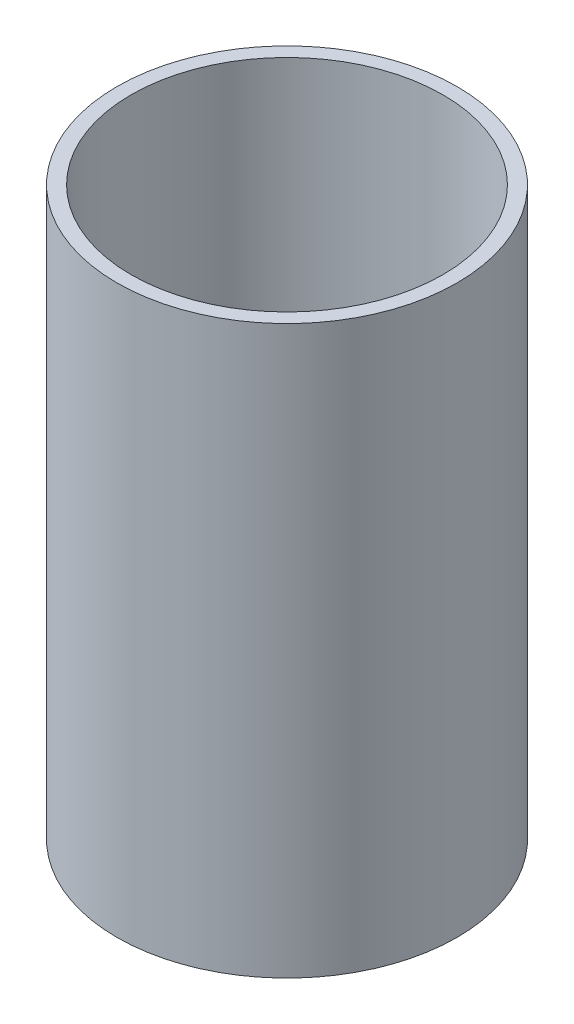
ISO-10303-21;
HEADER;
FILE_DESCRIPTION(('STEP AP214'),'2;1');
FILE_NAME('part.step','',(''),(''),'','','');
FILE_SCHEMA(('AUTOMOTIVE_DESIGN { 1 0 10303 214 1 1 1 1 }'));
ENDSEC;
DATA;
#1=APPLICATION_CONTEXT('core data for automotive mechanical design processes');
#2=APPLICATION_PROTOCOL_DEFINITION('international standard','automotive_design',2000,#1);
#3=PRODUCT_CONTEXT('',#1,'mechanical');
#4=PRODUCT('Part','Part','',(#3));
#5=PRODUCT_RELATED_PRODUCT_CATEGORY('part','',(#4));
#6=PRODUCT_DEFINITION_FORMATION('','',#4);
#7=PRODUCT_DEFINITION_CONTEXT('part definition',#1,'design');
#8=PRODUCT_DEFINITION('design','',#6,#7);
#9=PRODUCT_DEFINITION_SHAPE('','',#8);
#10=(LENGTH_UNIT() NAMED_UNIT(*) SI_UNIT(.MILLI.,.METRE.));
#11=(NAMED_UNIT(*) PLANE_ANGLE_UNIT() SI_UNIT($,.RADIAN.));
#12=(NAMED_UNIT(*) SI_UNIT($,.STERADIAN.) SOLID_ANGLE_UNIT());
#13=UNCERTAINTY_MEASURE_WITH_UNIT(LENGTH_MEASURE(1.E-05),#10,'distance_accuracy_value','');
#14=(GEOMETRIC_REPRESENTATION_CONTEXT(3) GLOBAL_UNCERTAINTY_ASSIGNED_CONTEXT((#13)) GLOBAL_UNIT_ASSIGNED_CONTEXT((#10,
#11,#12)) REPRESENTATION_CONTEXT('',''));
#15=CARTESIAN_POINT('',(0.,0.,0.));
#16=DIRECTION('',(0.,0.,1.));
#17=DIRECTION('',(1.,0.,0.));
#18=AXIS2_PLACEMENT_3D('',#15,#16,#17);
#19=CARTESIAN_POINT('',(0.,20.,0.));
#20=DIRECTION('',(0.,1.,0.));
#21=DIRECTION('',(0.,0.,1.));
#22=AXIS2_PLACEMENT_3D('',#19,#20,#21);
#23=PLANE('',#22);
#24=CARTESIAN_POINT('',(0.,20.,0.));
#25=DIRECTION('',(0.,1.,0.));
#26=DIRECTION('',(0.,0.,1.));
#27=AXIS2_PLACEMENT_3D('',#24,#25,#26);
#28=CIRCLE('',#27,6.);
#29=CARTESIAN_POINT('',(0.,20.,6.));
#30=VERTEX_POINT('',#29);
#31=EDGE_CURVE('E10',#30,#30,#28,.T.);
#32=ORIENTED_EDGE('',*,*,#31,.T.);
#33=EDGE_LOOP('',(#32));
#34=FACE_BOUND('',#33,.T.);
#35=CARTESIAN_POINT('',(0.,20.,0.));
#36=DIRECTION('',(0.,1.,0.));
#37=DIRECTION('',(0.,0.,1.));
#38=AXIS2_PLACEMENT_3D('',#35,#36,#37);
#39=CIRCLE('',#38,5.5);
#40=CARTESIAN_POINT('',(0.,20.,5.5));
#41=VERTEX_POINT('',#40);
#42=EDGE_CURVE('E46',#41,#41,#39,.T.);
#43=ORIENTED_EDGE('',*,*,#42,.F.);
#44=EDGE_LOOP('',(#43));
#45=FACE_BOUND('',#44,.T.);
#46=ADVANCED_FACE('F35',(#34,#45),#23,.T.);
#47=CARTESIAN_POINT('',(0.,0.,0.));
#48=DIRECTION('',(0.,1.,0.));
#49=DIRECTION('',(0.,0.,1.));
#50=AXIS2_PLACEMENT_3D('',#47,#48,#49);
#51=PLANE('',#50);
#52=CARTESIAN_POINT('',(0.,0.,0.));
#53=DIRECTION('',(0.,1.,0.));
#54=DIRECTION('',(0.,0.,1.));
#55=AXIS2_PLACEMENT_3D('',#52,#53,#54);
#56=CIRCLE('',#55,6.);
#57=CARTESIAN_POINT('',(0.,0.,6.));
#58=VERTEX_POINT('',#57);
#59=EDGE_CURVE('E39',#58,#58,#56,.T.);
#60=ORIENTED_EDGE('',*,*,#59,.F.);
#61=EDGE_LOOP('',(#60));
#62=FACE_BOUND('',#61,.T.);
#63=CARTESIAN_POINT('',(0.,0.,0.));
#64=DIRECTION('',(0.,1.,0.));
#65=DIRECTION('',(0.,0.,1.));
#66=AXIS2_PLACEMENT_3D('',#63,#64,#65);
#67=CIRCLE('',#66,5.5);
#68=CARTESIAN_POINT('',(0.,0.,5.5));
#69=VERTEX_POINT('',#68);
#70=EDGE_CURVE('E48',#69,#69,#67,.T.);
#71=ORIENTED_EDGE('',*,*,#70,.T.);
#72=EDGE_LOOP('',(#71));
#73=FACE_BOUND('',#72,.T.);
#74=ADVANCED_FACE('F58',(#62,#73),#51,.F.);
#75=CARTESIAN_POINT('',(0.,20.,0.));
#76=DIRECTION('',(0.,-1.,0.));
#77=DIRECTION('',(0.,0.,-1.));
#78=AXIS2_PLACEMENT_3D('',#75,#76,#77);
#79=CYLINDRICAL_SURFACE('',#78,6.);
#80=ORIENTED_EDGE('',*,*,#31,.F.);
#81=EDGE_LOOP('',(#80));
#82=FACE_BOUND('',#81,.T.);
#83=ORIENTED_EDGE('',*,*,#59,.T.);
#84=EDGE_LOOP('',(#83));
#85=FACE_BOUND('',#84,.T.);
#86=ADVANCED_FACE('F37',(#82,#85),#79,.T.);
#87=CARTESIAN_POINT('',(0.,20.,0.));
#88=DIRECTION('',(0.,-1.,0.));
#89=DIRECTION('',(0.,0.,-1.));
#90=AXIS2_PLACEMENT_3D('',#87,#88,#89);
#91=CYLINDRICAL_SURFACE('',#90,5.5);
#92=ORIENTED_EDGE('',*,*,#42,.T.);
#93=EDGE_LOOP('',(#92));
#94=FACE_BOUND('',#93,.T.);
#95=ORIENTED_EDGE('',*,*,#70,.F.);
#96=EDGE_LOOP('',(#95));
#97=FACE_BOUND('',#96,.T.);
#98=ADVANCED_FACE('F54',(#94,#97),#91,.F.);
#99=CLOSED_SHELL('',(#46,#74,#86,#98));
#100=MANIFOLD_SOLID_BREP('B2',#99);
#101=ADVANCED_BREP_SHAPE_REPRESENTATION('',(#18,#100),#14);
#102=SHAPE_DEFINITION_REPRESENTATION(#9,#101);
ENDSEC;
END-ISO-10303-21;
